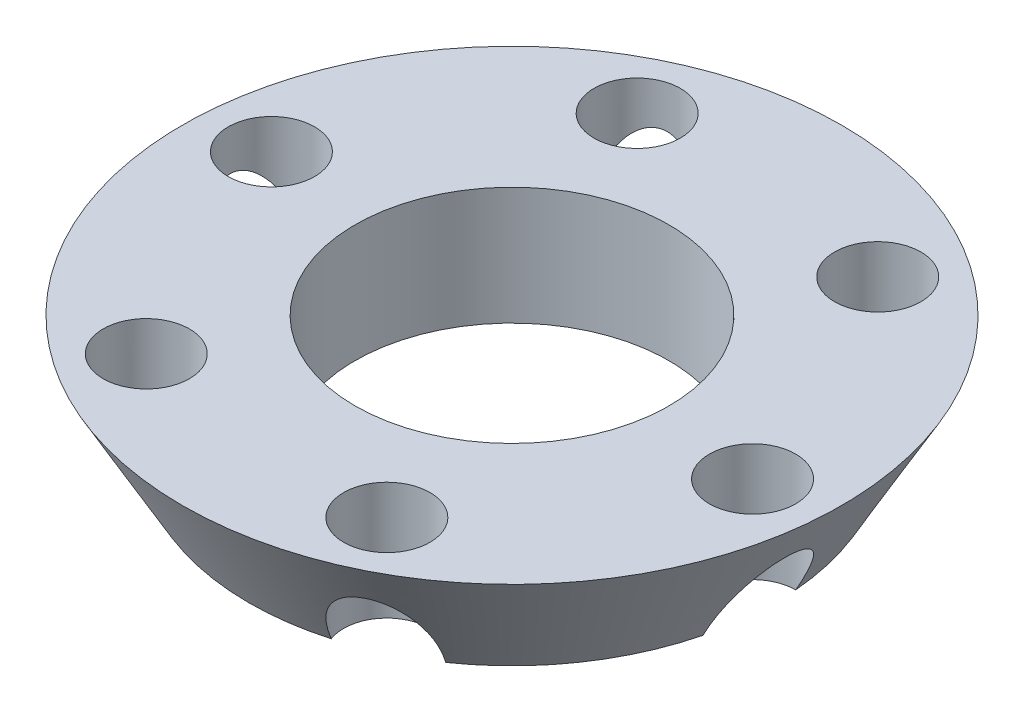
ISO-10303-21;
HEADER;
FILE_DESCRIPTION(('STEP AP214'),'2;1');
FILE_NAME('part.step','',(''),(''),'','','');
FILE_SCHEMA(('AUTOMOTIVE_DESIGN { 1 0 10303 214 1 1 1 1 }'));
ENDSEC;
DATA;
#1=APPLICATION_CONTEXT('core data for automotive mechanical design processes');
#2=APPLICATION_PROTOCOL_DEFINITION('international standard','automotive_design',2000,#1);
#3=PRODUCT_CONTEXT('',#1,'mechanical');
#4=PRODUCT('Part','Part','',(#3));
#5=PRODUCT_RELATED_PRODUCT_CATEGORY('part','',(#4));
#6=PRODUCT_DEFINITION_FORMATION('','',#4);
#7=PRODUCT_DEFINITION_CONTEXT('part definition',#1,'design');
#8=PRODUCT_DEFINITION('design','',#6,#7);
#9=PRODUCT_DEFINITION_SHAPE('','',#8);
#10=(LENGTH_UNIT() NAMED_UNIT(*) SI_UNIT(.MILLI.,.METRE.));
#11=(NAMED_UNIT(*) PLANE_ANGLE_UNIT() SI_UNIT($,.RADIAN.));
#12=(NAMED_UNIT(*) SI_UNIT($,.STERADIAN.) SOLID_ANGLE_UNIT());
#13=UNCERTAINTY_MEASURE_WITH_UNIT(LENGTH_MEASURE(1.E-05),#10,'distance_accuracy_value','');
#14=(GEOMETRIC_REPRESENTATION_CONTEXT(3) GLOBAL_UNCERTAINTY_ASSIGNED_CONTEXT((#13)) GLOBAL_UNIT_ASSIGNED_CONTEXT((#10,
#11,#12)) REPRESENTATION_CONTEXT('',''));
#15=CARTESIAN_POINT('',(0.,0.,0.));
#16=DIRECTION('',(0.,0.,1.));
#17=DIRECTION('',(1.,0.,0.));
#18=AXIS2_PLACEMENT_3D('',#15,#16,#17);
#19=CARTESIAN_POINT('',(0.,0.,0.));
#20=DIRECTION('',(0.,1.,0.));
#21=DIRECTION('',(0.,0.,1.));
#22=AXIS2_PLACEMENT_3D('',#19,#20,#21);
#23=CONICAL_SURFACE('',#22,16.75,0.515549007458979);
#24=CARTESIAN_POINT('',(0.,7.5,0.));
#25=DIRECTION('',(0.,1.,0.));
#26=DIRECTION('',(0.,0.,1.));
#27=AXIS2_PLACEMENT_3D('',#24,#25,#26);
#28=CIRCLE('',#27,21.);
#29=CARTESIAN_POINT('',(0.,7.5,21.));
#30=VERTEX_POINT('',#29);
#31=EDGE_CURVE('E136',#30,#30,#28,.T.);
#32=ORIENTED_EDGE('',*,*,#31,.F.);
#33=EDGE_LOOP('',(#32));
#34=FACE_BOUND('',#33,.T.);
#35=CARTESIAN_POINT('',(0.,0.,0.));
#36=DIRECTION('',(0.,1.,0.));
#37=DIRECTION('',(0.,0.,1.));
#38=AXIS2_PLACEMENT_3D('',#35,#36,#37);
#39=CIRCLE('',#38,16.75);
#40=CARTESIAN_POINT('',(9.54559790588086,0.,13.7638672133952));
#41=VERTEX_POINT('',#40);
#42=CARTESIAN_POINT('',(16.2458956094308,0.,4.07840359055817));
#43=VERTEX_POINT('',#42);
#44=EDGE_CURVE('E80',#41,#43,#39,.T.);
#45=ORIENTED_EDGE('',*,*,#44,.T.);
#46=CARTESIAN_POINT('',(16.2457834145786,-0.000199999999995974,4.07838504714579));
#47=CARTESIAN_POINT('',(16.302175127827,0.100324825842667,4.0877024616442));
#48=CARTESIAN_POINT('',(16.3589611894642,0.200780549594868,4.09528760056878));
#49=CARTESIAN_POINT('',(16.4732837268238,0.40148231099813,4.10691214319564));
#50=CARTESIAN_POINT('',(16.5308202743874,0.501728327492953,4.11095120487968));
#51=CARTESIAN_POINT('',(16.7047070615787,0.802405051376368,4.11763392608114));
#52=CARTESIAN_POINT('',(16.8221146213843,1.00238253421597,4.11480619108231));
#53=CARTESIAN_POINT('',(17.0596190871946,1.40084773593813,4.09344245155099));
#54=CARTESIAN_POINT('',(17.1797240030497,1.59932773603911,4.07485120512848));
#55=CARTESIAN_POINT('',(17.4214766125525,1.99276190965569,4.02020391943906));
#56=CARTESIAN_POINT('',(17.5431226495223,2.18771939962429,3.98416530263437));
#57=CARTESIAN_POINT('',(17.7210303415718,2.4683763125559,3.9170324164156));
#58=CARTESIAN_POINT('',(17.7770655790026,2.55613031469017,3.8938089577649));
#59=CARTESIAN_POINT('',(17.8891192186891,2.73030656197177,3.8428281058794));
#60=CARTESIAN_POINT('',(17.9451376213102,2.81672883844573,3.81507081947404));
#61=CARTESIAN_POINT('',(18.1130741194032,3.07381226223924,3.72438686070991));
#62=CARTESIAN_POINT('',(18.2247941765095,3.24216479725639,3.6540768538819));
#63=CARTESIAN_POINT('',(18.3908252232297,3.48809630694186,3.53061414951551));
#64=CARTESIAN_POINT('',(18.4461993119579,3.56938588819735,3.4861767473179));
#65=CARTESIAN_POINT('',(18.5558459290565,3.72881106158726,3.39062613683313));
#66=CARTESIAN_POINT('',(18.610118138803,3.80694574771973,3.33951102848604));
#67=CARTESIAN_POINT('',(18.7168024072488,3.95888372490284,3.2300601101336));
#68=CARTESIAN_POINT('',(18.7692197731615,4.03269984980142,3.17174748426186));
#69=CARTESIAN_POINT('',(18.8715379013854,4.17496867202895,3.04702174323222));
#70=CARTESIAN_POINT('',(18.9214408869651,4.24342613834306,2.98061596840136));
#71=CARTESIAN_POINT('',(19.0194432977473,4.37574467771692,2.83624564898847));
#72=CARTESIAN_POINT('',(19.0674092544424,4.43934474581093,2.75794626057492));
#73=CARTESIAN_POINT('',(19.1577663352949,4.55644380853141,2.59104618211514));
#74=CARTESIAN_POINT('',(19.2001568417672,4.60994168425614,2.50244435274193));
#75=CARTESIAN_POINT('',(19.2775158592622,4.70404705957815,2.31381181489615));
#76=CARTESIAN_POINT('',(19.3123808599616,4.74447817705664,2.21364765419836));
#77=CARTESIAN_POINT('',(19.3710350323901,4.80743443965891,2.00482190608852));
#78=CARTESIAN_POINT('',(19.3948487689347,4.82999937750279,1.89617979806795));
#79=CARTESIAN_POINT('',(19.426735544893,4.85270496249738,1.6899785505936));
#80=CARTESIAN_POINT('',(19.4365382510215,4.85552982383859,1.59298176384045));
#81=CARTESIAN_POINT('',(19.4457681153882,4.84554421463346,1.39929689200468));
#82=CARTESIAN_POINT('',(19.4451942875545,4.83273225824346,1.30260883713378));
#83=CARTESIAN_POINT('',(19.4349421082914,4.79508536234819,1.12362150645587));
#84=CARTESIAN_POINT('',(19.4262971297393,4.77176814902613,1.04092868205322));
#85=CARTESIAN_POINT('',(19.4023457111545,4.71551582378317,0.879954216808894));
#86=CARTESIAN_POINT('',(19.38703770799,4.68257845559063,0.801673615936039));
#87=CARTESIAN_POINT('',(19.3408659750967,4.58838439734069,0.608468881174297));
#88=CARTESIAN_POINT('',(19.3060811109865,4.52153882346547,0.49721459691286));
#89=CARTESIAN_POINT('',(19.2269176144129,4.37433300701095,0.287789195837885));
#90=CARTESIAN_POINT('',(19.1825125796073,4.2939357095665,0.189655310772523));
#91=CARTESIAN_POINT('',(19.0960359579004,4.13983382734168,0.023162383591909));
#92=CARTESIAN_POINT('',(19.0551089036005,4.06773514557948,-0.0473189863285882));
#93=CARTESIAN_POINT('',(18.9698894480725,3.9187643378716,-0.180871883109599));
#94=CARTESIAN_POINT('',(18.9255948925077,3.84188916203929,-0.243938599680744));
#95=CARTESIAN_POINT('',(18.8344089266928,3.68438254999452,-0.363370730179363));
#96=CARTESIAN_POINT('',(18.787513807288,3.60374577609714,-0.419726191821134));
#97=CARTESIAN_POINT('',(18.6917699641385,3.43958417883313,-0.526259085946489));
#98=CARTESIAN_POINT('',(18.6429205358852,3.35605831547543,-0.576434263424236));
#99=CARTESIAN_POINT('',(18.5044949302262,3.11973279044761,-0.708612423967674));
#100=CARTESIAN_POINT('',(18.4132709886688,2.96440314818071,-0.784393727779774));
#101=CARTESIAN_POINT('',(18.2278648508217,2.64872366899106,-0.920361064064815));
#102=CARTESIAN_POINT('',(18.1336802934595,2.48836982564886,-0.980534276249859));
#103=CARTESIAN_POINT('',(17.9433744148279,2.16385403163172,-1.08717551732313));
#104=CARTESIAN_POINT('',(17.8472495529699,1.9996850172257,-1.13361550289679));
#105=CARTESIAN_POINT('',(17.6541151029051,1.66896013446452,-1.21396961741687));
#106=CARTESIAN_POINT('',(17.5571058617444,1.50240518887262,-1.2478884599517));
#107=CARTESIAN_POINT('',(17.3314983733174,1.11374359985294,-1.31329214187503));
#108=CARTESIAN_POINT('',(17.2027657967137,0.890983275946897,-1.34049289883493));
#109=CARTESIAN_POINT('',(17.0104774062533,0.556476473421859,-1.36731465314002));
#110=CARTESIAN_POINT('',(16.9467511944364,0.445326009111038,-1.37392636522623));
#111=CARTESIAN_POINT('',(16.8194878746836,0.222746444921253,-1.38268421250332));
#112=CARTESIAN_POINT('',(16.7559507592794,0.111317356375088,-1.38483052645477));
#113=CARTESIAN_POINT('',(16.6925444906577,-0.000199999999998144,-1.3847966542393));
#114=B_SPLINE_CURVE_WITH_KNOTS('',3,(#46,#47,#48,#49,#50,#51,#52,#53,#54,#55,#56,#57,#58,#59,
#60,#61,#62,#63,#64,#65,#66,#67,#68,#69,#70,#71,#72,#73,#74,#75,#76,#77,#78,#79,#80,#81,#82,#83,
#84,#85,#86,#87,#88,#89,#90,#91,#92,#93,#94,#95,#96,#97,#98,#99,#100,#101,#102,#103,#104,#105,
#106,#107,#108,#109,#110,#111,#112,#113),.UNSPECIFIED.,.F.,.F.,(4,2,2,2,2,2,2,2,2,2,2,2,2,2,2,2,
2,2,2,2,2,2,2,2,2,2,2,2,2,2,2,2,2,4),(0.,0.346883433123776,0.693800319390656,1.38898423849557,
2.08661448793963,2.78354953549463,3.10348603008158,3.42341498717202,4.06372436430891,
4.38731933820733,4.71100658847554,5.0336771536517,5.35605721097546,5.69027239091061,
6.02452456626997,6.36311654490102,6.70095225117751,6.99176152844596,7.28259844118191,
7.54065788536925,7.79877790242766,8.19961146246676,8.60155936101379,8.92755685381976,
9.25376468535514,9.58045038871827,9.907254939298,10.4925881298666,11.0784005939849,
11.6654011581569,12.2521805198816,13.0275034707226,13.4123212473931,13.7971236185899),.UNSPECIFIED.);
#115=CARTESIAN_POINT('',(16.6926595634952,0.,-1.38479683579284));
#116=VERTEX_POINT('',#115);
#117=EDGE_CURVE('E12',#43,#116,#114,.T.);
#118=ORIENTED_EDGE('',*,*,#117,.T.);
#119=CARTESIAN_POINT('',(11.6549489210247,0.,-12.0301565097178));
#120=VERTEX_POINT('',#119);
#121=EDGE_CURVE('E261',#116,#120,#39,.T.);
#122=ORIENTED_EDGE('',*,*,#121,.T.);
#123=CARTESIAN_POINT('',(11.6548767645324,-0.000200000000001229,-12.0300686178317));
#124=CARTESIAN_POINT('',(11.6911417388099,0.100324825842663,-12.0742465668186));
#125=CARTESIAN_POINT('',(11.7261036926284,0.200780549594865,-12.119632169315));
#126=CARTESIAN_POINT('',(11.7933321105305,0.401482310998129,-12.21282611958));
#127=CARTESIAN_POINT('',(11.8255983143381,0.501728327492952,-12.2606347005742));
#128=CARTESIAN_POINT('',(11.9183291142607,0.80240505137637,-12.4078837150635));
#129=CARTESIAN_POINT('',(11.9745840038193,1.00238253421598,-12.5109755119509));
#130=CARTESIAN_POINT('',(12.0748346955706,1.40084773593814,-12.7273422826204));
#131=CARTESIAN_POINT('',(12.1187866618083,1.59932773603913,-12.8406518140816));
#132=CARTESIAN_POINT('',(12.1923370289049,1.99276190965572,-13.0773393581869));
#133=CARTESIAN_POINT('',(12.2219496897197,2.18771939962433,-13.2007072248747));
#134=CARTESIAN_POINT('',(12.2527647508497,2.468376312556,-13.3883462488276));
#135=CARTESIAN_POINT('',(12.2606702644099,2.55613031469033,-13.4484859172752));
#136=CARTESIAN_POINT('',(12.2725463714137,2.73030656197204,-13.571017641773));
#137=CARTESIAN_POINT('',(12.2765170575572,2.81672883844606,-13.633409644725));
#138=CARTESIAN_POINT('',(12.2819506945982,3.07381226223973,-13.8241888976782));
#139=CARTESIAN_POINT('',(12.2769204710981,3.24216479725699,-13.9560963086586));
#140=CARTESIAN_POINT('',(12.253014156057,3.48809630694262,-14.1616147651185));
#141=CARTESIAN_POINT('',(12.2422172812398,3.56938588819815,-14.2317888337674));
#142=CARTESIAN_POINT('',(12.2142913337622,3.72881106158817,-14.3745208948563));
#143=CARTESIAN_POINT('',(12.1971604562897,3.80694574772069,-14.4470795613899));
#144=CARTESIAN_POINT('',(12.1557153147518,3.9588837249039,-14.5941963072243));
#145=CARTESIAN_POINT('',(12.1314237823419,4.03269984980253,-14.6687473906401));
#146=CARTESIAN_POINT('',(12.0745671862163,4.17496867203015,-14.8197203594646));
#147=CARTESIAN_POINT('',(12.0420095910447,4.24342613834431,-14.8961405001168));
#148=CARTESIAN_POINT('',(11.9659824322717,4.37574467771822,-15.0531982371928));
#149=CARTESIAN_POINT('',(11.9221561511524,4.43934474581223,-15.1338876684144));
#150=CARTESIAN_POINT('',(11.8227949837388,4.55644380853272,-15.2955892350743));
#151=CARTESIAN_POINT('',(11.767258801916,4.60994168425746,-15.3766014052452));
#152=CARTESIAN_POINT('',(11.6425777409088,4.70404705957949,-15.5379125485306));
#153=CARTESIAN_POINT('',(11.5732655335454,4.74447817705799,-15.6181886051881));
#154=CARTESIAN_POINT('',(11.4217442169323,4.80743443966028,-15.7733974826041));
#155=CARTESIAN_POINT('',(11.3395642597381,4.82999937750417,-15.848341837421));
#156=CARTESIAN_POINT('',(11.1769321291124,4.85270496249878,-15.9790572191829));
#157=CARTESIAN_POINT('',(11.097831800763,4.85552982384,-16.0360450050926));
#158=CARTESIAN_POINT('',(10.9347107136078,4.84554421463489,-16.1408807380256));
#159=CARTESIAN_POINT('',(10.8506894879303,4.8327322582449,-16.1887278159797));
#160=CARTESIAN_POINT('',(10.6905558229761,4.79508536234964,-16.2693428336327));
#161=CARTESIAN_POINT('',(10.6146192470566,4.77176814902758,-16.3032024747926));
#162=CARTESIAN_POINT('',(10.463235561502,4.71551582378464,-16.3629471704637));
#163=CARTESIAN_POINT('',(10.3877885709404,4.6825784555921,-16.3888303512785));
#164=CARTESIAN_POINT('',(10.1973824960586,4.58838439734218,-16.445446825037));
#165=CARTESIAN_POINT('',(10.0836410275533,4.52153882346697,-16.4709493911812));
#166=CARTESIAN_POINT('',(9.86269156173785,4.37433300701248,-16.5071044926335));
#167=CARTESIAN_POINT('',(9.75550260689639,4.29393570956804,-16.5177155469686));
#168=CARTESIAN_POINT('',(9.5680771915541,4.13983382734325,-16.5260710593273));
#169=CARTESIAN_POINT('',(9.48657500755946,4.06773514558106,-16.5258678755617));
#170=CARTESIAN_POINT('',(9.32830507843415,3.91876433787321,-16.5188421105684));
#171=CARTESIAN_POINT('',(9.25154042196783,3.84188916204092,-16.5120152584854));
#172=CARTESIAN_POINT('',(9.10251618002049,3.68438254999617,-16.4927619608704));
#173=CARTESIAN_POINT('',(9.03026335889433,3.60374577609881,-16.4803273269733));
#174=CARTESIAN_POINT('',(8.89013124466836,3.43958417883482,-16.4506771736126));
#175=CARTESIAN_POINT('',(8.82225355220661,3.35605831547713,-16.4334599165238));
#176=CARTESIAN_POINT('',(8.63857110452097,3.11973279044935,-16.3796689057605));
#177=CARTESIAN_POINT('',(8.5273305995091,2.96440314818248,-16.3385573068446));
#178=CARTESIAN_POINT('',(8.31687636327783,2.64872366899288,-16.245974549594));
#179=CARTESIAN_POINT('',(8.21767255421718,2.48836982565071,-16.1944949363667));
#180=CARTESIAN_POINT('',(8.03016559104082,2.16385403163361,-16.0830058315189));
#181=CARTESIAN_POINT('',(7.94188495285365,1.99968501722761,-16.0229792520015));
#182=CARTESIAN_POINT('',(7.77572902334824,1.66896013446649,-15.8958969691595));
#183=CARTESIAN_POINT('',(7.69784982346579,1.50240518887461,-15.8288439231799));
#184=CARTESIAN_POINT('',(7.52840482920543,1.11374359985462,-15.6661639478796));
#185=CARTESIAN_POINT('',(7.440481994374,0.890983275948242,-15.568278644726));
#186=CARTESIAN_POINT('',(7.32110947854137,0.556476473422697,-15.4151628908868));
#187=CARTESIAN_POINT('',(7.28352046200372,0.445326009111708,-15.3632802286095));
#188=CARTESIAN_POINT('',(7.21230428390282,0.222746444921588,-15.257445884372));
#189=CARTESIAN_POINT('',(7.17867696379422,0.111317356375255,-15.2034942853244));
#190=CARTESIAN_POINT('',(7.14700316368239,-0.000199999999997017,-15.1485659098309));
#191=B_SPLINE_CURVE_WITH_KNOTS('',3,(#123,#124,#125,#126,#127,#128,#129,#130,#131,#132,#133,
#134,#135,#136,#137,#138,#139,#140,#141,#142,#143,#144,#145,#146,#147,#148,#149,#150,#151,#152,
#153,#154,#155,#156,#157,#158,#159,#160,#161,#162,#163,#164,#165,#166,#167,#168,#169,#170,#171,
#172,#173,#174,#175,#176,#177,#178,#179,#180,#181,#182,#183,#184,#185,#186,#187,#188,#189,#190),
.UNSPECIFIED.,.F.,.F.,(4,2,2,2,2,2,2,2,2,2,2,2,2,2,2,2,2,2,2,2,2,2,2,2,2,2,2,2,2,2,2,2,2,4),(0.,
0.346883433123777,0.693800319390655,1.38898423849557,2.08661448793962,2.78354953549462,
3.10348603008174,3.42341498717236,4.06372436430961,4.38731933820821,4.7110065884766,
5.03367715365294,5.35605721097688,5.69027239091203,6.0245245662714,6.36311654490245,
6.70095225117894,6.99176152844742,7.28259844118339,7.54065788537072,7.79877790242914,
8.19961146246819,8.60155936101519,8.92755685382111,9.25376468535645,9.58045038871954,
9.90725493929922,10.4925881298677,11.078400593986,11.6654011581579,12.2521805198826,
13.0275034707247,13.4123212473957,13.7971236185932),.UNSPECIFIED.);
#192=CARTESIAN_POINT('',(7.14705985748153,0.,-15.1486642038932));
#193=VERTEX_POINT('',#192);
#194=EDGE_CURVE('E353',#120,#193,#191,.T.);
#195=ORIENTED_EDGE('',*,*,#194,.T.);
#196=CARTESIAN_POINT('',(-4.59094668840506,0.,-16.1085601002766));
#197=VERTEX_POINT('',#196);
#198=EDGE_CURVE('E266',#193,#197,#39,.T.);
#199=ORIENTED_EDGE('',*,*,#198,.T.);
#200=CARTESIAN_POINT('',(-4.59090665004514,-0.000199999999998536,-16.1084536649782));
#201=CARTESIAN_POINT('',(-4.61103338901614,0.100324825842664,-16.1619490284635));
#202=CARTESIAN_POINT('',(-4.63285749683477,0.200780549594866,-16.2149197698844));
#203=CARTESIAN_POINT('',(-4.67995161629231,0.401482310998131,-16.3197382627764));
#204=CARTESIAN_POINT('',(-4.70522196004829,0.501728327492954,-16.3715859054546));
#205=CARTESIAN_POINT('',(-4.78637794731697,0.802405051376374,-16.5255176411454));
#206=CARTESIAN_POINT('',(-4.84753061756388,1.00238253421598,-16.625781703034));
#207=CARTESIAN_POINT('',(-4.9847843916229,1.40084773593814,-16.8207847341724));
#208=CARTESIAN_POINT('',(-5.06093734124036,1.59932773603913,-16.9155030192111));
#209=CARTESIAN_POINT('',(-5.22913958364655,1.99276190965572,-17.097543277627));
#210=CARTESIAN_POINT('',(-5.32117295980151,2.18771939962433,-17.1848725275102));
#211=CARTESIAN_POINT('',(-5.46826559072105,2.468376312556,-17.3053786652445));
#212=CARTESIAN_POINT('',(-5.51639531459171,2.55613031469033,-17.3422948750413));
#213=CARTESIAN_POINT('',(-5.61657284727437,2.73030656197204,-17.4138457476536));
#214=CARTESIAN_POINT('',(-5.66862056375212,2.81672883844605,-17.4484804642003));
#215=CARTESIAN_POINT('',(-5.83112342480409,3.07381226223973,-17.5485757583894));
#216=CARTESIAN_POINT('',(-5.94787370541059,3.24216479725698,-17.6101731625418));
#217=CARTESIAN_POINT('',(-6.13781106717197,3.48809630694261,-17.6922289146353));
#218=CARTESIAN_POINT('',(-6.2039820307174,3.56938588819814,-17.7179655810865));
#219=CARTESIAN_POINT('',(-6.34155459529367,3.72881106158816,-17.7651470316906));
#220=CARTESIAN_POINT('',(-6.41295768251275,3.80694574772068,-17.7865905898772));
#221=CARTESIAN_POINT('',(-6.56108709249644,3.95888372490389,-17.8242564173592));
#222=CARTESIAN_POINT('',(-6.63779599081913,4.03269984980252,-17.8404948749032));
#223=CARTESIAN_POINT('',(-6.79697071516868,4.17496867203013,-17.866742102698));
#224=CARTESIAN_POINT('',(-6.87943129592009,4.24342613834429,-17.8767564685193));
#225=CARTESIAN_POINT('',(-7.05346086547526,4.3757446777182,-17.8894438861824));
#226=CARTESIAN_POINT('',(-7.14525310328972,4.43934474581221,-17.8918339289904));
#227=CARTESIAN_POINT('',(-7.33497135155574,4.55644380853271,-17.8866354171906));
#228=CARTESIAN_POINT('',(-7.43289803985088,4.60994168425744,-17.8790457579883));
#229=CARTESIAN_POINT('',(-7.63493811835316,4.70404705957947,-17.851724363428));
#230=CARTESIAN_POINT('',(-7.73911532641586,4.74447817705797,-17.8318362593877));
#231=CARTESIAN_POINT('',(-7.94929081545752,4.80743443966026,-17.7782193886938));
#232=CARTESIAN_POINT('',(-8.05528450919632,4.82999937750415,-17.7445216354902));
#233=CARTESIAN_POINT('',(-8.24980341578036,4.85270496249877,-17.6690357697778));
#234=CARTESIAN_POINT('',(-8.33870645025832,4.85552982383998,-17.6290267689343));
#235=CARTESIAN_POINT('',(-8.5110574017802,4.84554421463487,-17.5401776300315));
#236=CARTESIAN_POINT('',(-8.59450479962406,4.83273225824487,-17.4913366531147));
#237=CARTESIAN_POINT('',(-8.74438628531518,4.79508536234962,-17.3929643400897));
#238=CARTESIAN_POINT('',(-8.81167788268248,4.77176814902757,-17.3441311568471));
#239=CARTESIAN_POINT('',(-8.9391101496523,4.71551582378463,-17.2429013872738));
#240=CARTESIAN_POINT('',(-8.99924913704949,4.68257845559208,-17.1905039672158));
#241=CARTESIAN_POINT('',(-9.14348347903792,4.58838439734215,-17.0539157062125));
#242=CARTESIAN_POINT('',(-9.22244008343311,4.52153882346694,-16.9681639880953));
#243=CARTESIAN_POINT('',(-9.36422605267499,4.37433300701246,-16.7948936884726));
#244=CARTESIAN_POINT('',(-9.42700997271086,4.29393570956802,-16.7073708577424));
#245=CARTESIAN_POINT('',(-9.52795876634627,4.13983382734323,-16.5492334429205));
#246=CARTESIAN_POINT('',(-9.56853389604099,4.06773514558104,-16.4785488892344));
#247=CARTESIAN_POINT('',(-9.6415843696384,3.91876433787319,-16.3379702274601));
#248=CARTESIAN_POINT('',(-9.67405447053985,3.84188916204089,-16.268076658806));
#249=CARTESIAN_POINT('',(-9.73189274667232,3.68438254999614,-16.1293912306924));
#250=CARTESIAN_POINT('',(-9.75725044839371,3.60374577609878,-16.0606011351535));
#251=CARTESIAN_POINT('',(-9.80163871947022,3.43958417883479,-15.9244180876674));
#252=CARTESIAN_POINT('',(-9.82066698367873,3.3560583154771,-15.8570256531009));
#253=CARTESIAN_POINT('',(-9.86592382570533,3.11973279044932,-15.6710564817942));
#254=CARTESIAN_POINT('',(-9.88594038915985,2.96440314818244,-15.5541635790661));
#255=CARTESIAN_POINT('',(-9.91098848754411,2.64872366899284,-15.3256134855305));
#256=CARTESIAN_POINT('',(-9.9160077392426,2.48836982565067,-15.2139606601181));
#257=CARTESIAN_POINT('',(-9.91320882378738,2.16385403163357,-14.995830314197));
#258=CARTESIAN_POINT('',(-9.90536460011658,1.99968501722757,-14.8893637491059));
#259=CARTESIAN_POINT('',(-9.87838607955721,1.66896013446644,-14.6819273517438));
#260=CARTESIAN_POINT('',(-9.85925603827902,1.50240518887456,-14.5809554632294));
#261=CARTESIAN_POINT('',(-9.80309354411213,1.11374359985458,-14.3528718060057));
#262=CARTESIAN_POINT('',(-9.76228380233966,0.890983275948215,-14.2277857458921));
#263=CARTESIAN_POINT('',(-9.68936792771165,0.556476473422687,-14.0478482377478));
#264=CARTESIAN_POINT('',(-9.66323073243235,0.445326009111704,-13.9893538633843));
#265=CARTESIAN_POINT('',(-9.60718359078029,0.222746444921593,-13.8747616718697));
#266=CARTESIAN_POINT('',(-9.57727379548459,0.111317356375266,-13.8186637588707));
#267=CARTESIAN_POINT('',(-9.54554132697456,-0.000199999999981395,-13.7637692555927));
#268=B_SPLINE_CURVE_WITH_KNOTS('',3,(#200,#201,#202,#203,#204,#205,#206,#207,#208,#209,#210,
#211,#212,#213,#214,#215,#216,#217,#218,#219,#220,#221,#222,#223,#224,#225,#226,#227,#228,#229,
#230,#231,#232,#233,#234,#235,#236,#237,#238,#239,#240,#241,#242,#243,#244,#245,#246,#247,#248,
#249,#250,#251,#252,#253,#254,#255,#256,#257,#258,#259,#260,#261,#262,#263,#264,#265,#266,#267),
.UNSPECIFIED.,.F.,.F.,(4,2,2,2,2,2,2,2,2,2,2,2,2,2,2,2,2,2,2,2,2,2,2,2,2,2,2,2,2,2,2,2,2,4),(0.,
0.346883433123777,0.693800319390656,1.38898423849557,2.08661448793962,2.78354953549462,
3.10348603008174,3.42341498717236,4.0637243643096,4.38731933820819,4.71100658847659,
5.03367715365292,5.35605721097686,5.69027239091201,6.02452456627138,6.36311654490243,
6.70095225117893,6.9917615284474,7.28259844118337,7.54065788537071,7.79877790242912,
8.19961146246818,8.60155936101517,8.92755685382109,9.25376468535644,9.58045038871953,
9.90725493929921,10.4925881298677,11.078400593986,11.6654011581579,12.2521805198826,
13.0275034707247,13.4123212473957,13.7971236185931),.UNSPECIFIED.);
#269=CARTESIAN_POINT('',(-9.54559790587994,0.,-13.7638672133958));
#270=VERTEX_POINT('',#269);
#271=EDGE_CURVE('E351',#197,#270,#268,.T.);
#272=ORIENTED_EDGE('',*,*,#271,.T.);
#273=CARTESIAN_POINT('',(-16.2458956094303,0.,-4.07840359055998));
#274=VERTEX_POINT('',#273);
#275=EDGE_CURVE('E154',#270,#274,#39,.T.);
#276=ORIENTED_EDGE('',*,*,#275,.T.);
#277=CARTESIAN_POINT('',(-16.2457834145781,-0.000199999999994494,-4.0783850471476));
#278=CARTESIAN_POINT('',(-16.3021751278266,0.100324825842668,-4.08770246164601));
#279=CARTESIAN_POINT('',(-16.3589611894637,0.200780549594869,-4.0952876005706));
#280=CARTESIAN_POINT('',(-16.4732837268233,0.401482310998131,-4.10691214319747));
#281=CARTESIAN_POINT('',(-16.530820274387,0.501728327492953,-4.11095120488152));
#282=CARTESIAN_POINT('',(-16.7047070615782,0.802405051376368,-4.11763392608299));
#283=CARTESIAN_POINT('',(-16.8221146213838,1.00238253421597,-4.11480619108417));
#284=CARTESIAN_POINT('',(-17.0596190871941,1.40084773593813,-4.09344245155288));
#285=CARTESIAN_POINT('',(-17.1797240030493,1.59932773603911,-4.07485120513038));
#286=CARTESIAN_POINT('',(-17.4214766125521,1.99276190965569,-4.02020391944099));
#287=CARTESIAN_POINT('',(-17.5431226495219,2.18771939962429,-3.98416530263631));
#288=CARTESIAN_POINT('',(-17.7210303415714,2.46837631255589,-3.91703241641756));
#289=CARTESIAN_POINT('',(-17.7770655790022,2.55613031469017,-3.89380895776686));
#290=CARTESIAN_POINT('',(-17.8891192186887,2.73030656197177,-3.84282810588137));
#291=CARTESIAN_POINT('',(-17.9451376213098,2.81672883844572,-3.81507081947602));
#292=CARTESIAN_POINT('',(-18.1130741194027,3.07381226223923,-3.7243868607119));
#293=CARTESIAN_POINT('',(-18.2247941765091,3.24216479725637,-3.6540768538839));
#294=CARTESIAN_POINT('',(-18.3908252232293,3.48809630694184,-3.53061414951754));
#295=CARTESIAN_POINT('',(-18.4461993119575,3.56938588819733,-3.48617674731993));
#296=CARTESIAN_POINT('',(-18.5558459290561,3.72881106158724,-3.39062613683518));
#297=CARTESIAN_POINT('',(-18.6101181388027,3.8069457477197,-3.3395110284881));
#298=CARTESIAN_POINT('',(-18.7168024072484,3.95888372490281,-3.23006011013566));
#299=CARTESIAN_POINT('',(-18.7692197731611,4.03269984980139,-3.17174748426393));
#300=CARTESIAN_POINT('',(-18.8715379013851,4.17496867202891,-3.0470217432343));
#301=CARTESIAN_POINT('',(-18.9214408869648,4.24342613834303,-2.98061596840344));
#302=CARTESIAN_POINT('',(-19.019443297747,4.37574467771689,-2.83624564899057));
#303=CARTESIAN_POINT('',(-19.0674092544421,4.43934474581089,-2.75794626057702));
#304=CARTESIAN_POINT('',(-19.1577663352946,4.55644380853137,-2.59104618211726));
#305=CARTESIAN_POINT('',(-19.2001568417669,4.6099416842561,-2.50244435274404));
#306=CARTESIAN_POINT('',(-19.277515859262,4.70404705957811,-2.31381181489827));
#307=CARTESIAN_POINT('',(-19.3123808599613,4.74447817705661,-2.21364765420049));
#308=CARTESIAN_POINT('',(-19.3710350323898,4.80743443965888,-2.00482190609065));
#309=CARTESIAN_POINT('',(-19.3948487689344,4.82999937750275,-1.89617979807009));
#310=CARTESIAN_POINT('',(-19.4267355448928,4.85270496249734,-1.68997855059574));
#311=CARTESIAN_POINT('',(-19.4365382510214,4.85552982383855,-1.59298176384259));
#312=CARTESIAN_POINT('',(-19.4457681153881,4.84554421463342,-1.39929689200683));
#313=CARTESIAN_POINT('',(-19.4451942875544,4.83273225824341,-1.30260883713593));
#314=CARTESIAN_POINT('',(-19.4349421082913,4.79508536234815,-1.12362150645801));
#315=CARTESIAN_POINT('',(-19.4262971297391,4.77176814902609,-1.04092868205536));
#316=CARTESIAN_POINT('',(-19.4023457111544,4.71551582378314,-0.879954216811034));
#317=CARTESIAN_POINT('',(-19.3870377079899,4.68257845559059,-0.801673615938178));
#318=CARTESIAN_POINT('',(-19.3408659750966,4.58838439734064,-0.608468881176432));
#319=CARTESIAN_POINT('',(-19.3060811109865,4.52153882346542,-0.497214596914992));
#320=CARTESIAN_POINT('',(-19.2269176144129,4.37433300701091,-0.287789195840011));
#321=CARTESIAN_POINT('',(-19.1825125796073,4.29393570956645,-0.189655310774645));
#322=CARTESIAN_POINT('',(-19.0960359579004,4.13983382734163,-0.0231623835940201));
#323=CARTESIAN_POINT('',(-19.0551089036004,4.06773514557944,0.0473189863264847));
#324=CARTESIAN_POINT('',(-18.9698894480725,3.91876433787156,0.180871883107505));
#325=CARTESIAN_POINT('',(-18.9255948925077,3.84188916203925,0.243938599678653));
#326=CARTESIAN_POINT('',(-18.8344089266928,3.68438254999447,0.363370730177281));
#327=CARTESIAN_POINT('',(-18.787513807288,3.6037457760971,0.419726191819059));
#328=CARTESIAN_POINT('',(-18.6917699641385,3.43958417883308,0.526259085944425));
#329=CARTESIAN_POINT('',(-18.6429205358853,3.35605831547538,0.576434263422177));
#330=CARTESIAN_POINT('',(-18.5044949302262,3.11973279044756,0.708612423965629));
#331=CARTESIAN_POINT('',(-18.4132709886688,2.96440314818066,0.78439372777774));
#332=CARTESIAN_POINT('',(-18.2278648508218,2.64872366899101,0.920361064062803));
#333=CARTESIAN_POINT('',(-18.1336802934596,2.48836982564881,0.980534276247858));
#334=CARTESIAN_POINT('',(-17.943374414828,2.16385403163167,1.08717551732115));
#335=CARTESIAN_POINT('',(-17.84724955297,1.99968501722564,1.13361550289482));
#336=CARTESIAN_POINT('',(-17.6541151029052,1.66896013446446,1.21396961741492));
#337=CARTESIAN_POINT('',(-17.5571058617446,1.50240518887256,1.24788845994975));
#338=CARTESIAN_POINT('',(-17.3314983733175,1.11374359985289,1.31329214187311));
#339=CARTESIAN_POINT('',(-17.2027657967138,0.890983275946859,1.34049289883302));
#340=CARTESIAN_POINT('',(-17.0104774062534,0.556476473421837,1.36731465313813));
#341=CARTESIAN_POINT('',(-16.9467511944366,0.445326009111021,1.37392636522436));
#342=CARTESIAN_POINT('',(-16.8194878746838,0.222746444921246,1.38268421250146));
#343=CARTESIAN_POINT('',(-16.7559507592796,0.111317356375085,1.38483052645292));
#344=CARTESIAN_POINT('',(-16.6925444906578,-0.000199999999997812,1.38479665423745));
#345=B_SPLINE_CURVE_WITH_KNOTS('',3,(#277,#278,#279,#280,#281,#282,#283,#284,#285,#286,#287,
#288,#289,#290,#291,#292,#293,#294,#295,#296,#297,#298,#299,#300,#301,#302,#303,#304,#305,#306,
#307,#308,#309,#310,#311,#312,#313,#314,#315,#316,#317,#318,#319,#320,#321,#322,#323,#324,#325,
#326,#327,#328,#329,#330,#331,#332,#333,#334,#335,#336,#337,#338,#339,#340,#341,#342,#343,#344),
.UNSPECIFIED.,.F.,.F.,(4,2,2,2,2,2,2,2,2,2,2,2,2,2,2,2,2,2,2,2,2,2,2,2,2,2,2,2,2,2,2,2,2,4),(0.,
0.346883433123777,0.693800319390656,1.38898423849557,2.08661448793963,2.78354953549464,
3.10348603008158,3.42341498717201,4.06372436430889,4.3873193382073,4.71100658847552,
5.03367715365167,5.35605721097542,5.69027239091057,6.02452456626993,6.36311654490098,
6.70095225117747,6.99176152844593,7.28259844118187,7.54065788536921,7.79877790242763,
8.19961146246673,8.60155936101376,8.92755685381972,9.2537646853551,9.58045038871824,
9.90725493929796,10.4925881298665,11.0784005939849,11.6654011581569,12.2521805198816,
13.0275034707226,13.412321247393,13.7971236185899),.UNSPECIFIED.);
#346=CARTESIAN_POINT('',(-16.6926595634952,0.,1.38479683579098));
#347=VERTEX_POINT('',#346);
#348=EDGE_CURVE('E135',#274,#347,#345,.T.);
#349=ORIENTED_EDGE('',*,*,#348,.T.);
#350=CARTESIAN_POINT('',(-11.6549489210255,0.,12.030156509717));
#351=VERTEX_POINT('',#350);
#352=EDGE_CURVE('E143',#347,#351,#39,.T.);
#353=ORIENTED_EDGE('',*,*,#352,.T.);
#354=CARTESIAN_POINT('',(-11.6548767645332,-0.000199999999999733,12.030068617831));
#355=CARTESIAN_POINT('',(-11.6911417388106,0.100324825842662,12.0742465668179));
#356=CARTESIAN_POINT('',(-11.7261036926291,0.200780549594862,12.1196321693143));
#357=CARTESIAN_POINT('',(-11.7933321105311,0.401482310998122,12.2128261195794));
#358=CARTESIAN_POINT('',(-11.8255983143388,0.501728327492943,12.2606347005736));
#359=CARTESIAN_POINT('',(-11.9183291142612,0.802405051376355,12.4078837150629));
#360=CARTESIAN_POINT('',(-11.9745840038198,1.00238253421595,12.5109755119504));
#361=CARTESIAN_POINT('',(-12.074834695571,1.4008477359381,12.72734228262));
#362=CARTESIAN_POINT('',(-12.1187866618086,1.59932773603908,12.8406518140813));
#363=CARTESIAN_POINT('',(-12.1923370289051,1.99276190965564,13.0773393581866));
#364=CARTESIAN_POINT('',(-12.2219496897198,2.18771939962424,13.2007072248745));
#365=CARTESIAN_POINT('',(-12.2527647508497,2.46837631255578,13.3883462488274));
#366=CARTESIAN_POINT('',(-12.2606702644099,2.55613031468999,13.4484859172749));
#367=CARTESIAN_POINT('',(-12.2725463714136,2.73030656197149,13.5710176417726));
#368=CARTESIAN_POINT('',(-12.2765170575571,2.81672883844539,13.6334096447246));
#369=CARTESIAN_POINT('',(-12.281950694598,3.07381226223874,13.8241888976777));
#370=CARTESIAN_POINT('',(-12.2769204710978,3.24216479725578,13.9560963086579));
#371=CARTESIAN_POINT('',(-12.2530141560567,3.48809630694109,14.1616147651177));
#372=CARTESIAN_POINT('',(-12.2422172812394,3.56938588819652,14.2317888337664));
#373=CARTESIAN_POINT('',(-12.2142913337618,3.72881106158633,14.3745208948552));
#374=CARTESIAN_POINT('',(-12.1971604562893,3.80694574771874,14.4470795613887));
#375=CARTESIAN_POINT('',(-12.1557153147515,3.95888372490175,14.5941963072231));
#376=CARTESIAN_POINT('',(-12.1314237823415,4.03269984980029,14.6687473906388));
#377=CARTESIAN_POINT('',(-12.074567186216,4.17496867202771,14.8197203594631));
#378=CARTESIAN_POINT('',(-12.0420095910444,4.24342613834179,14.8961405001152));
#379=CARTESIAN_POINT('',(-11.9659824322715,4.3757446777156,15.0531982371911));
#380=CARTESIAN_POINT('',(-11.9221561511521,4.4393447458096,15.1338876684127));
#381=CARTESIAN_POINT('',(-11.8227949837385,4.55644380853007,15.2955892350726));
#382=CARTESIAN_POINT('',(-11.7672588019157,4.60994168425478,15.3766014052436));
#383=CARTESIAN_POINT('',(-11.6425777409085,4.70404705957678,15.5379125485289));
#384=CARTESIAN_POINT('',(-11.5732655335451,4.74447817705526,15.6181886051864));
#385=CARTESIAN_POINT('',(-11.4217442169319,4.80743443965751,15.7733974826024));
#386=CARTESIAN_POINT('',(-11.3395642597377,4.82999937750137,15.8483418374193));
#387=CARTESIAN_POINT('',(-11.1769321291121,4.85270496249595,15.9790572191812));
#388=CARTESIAN_POINT('',(-11.0978318007626,4.85552982383715,16.0360450050909));
#389=CARTESIAN_POINT('',(-10.9347107136075,4.845544214632,16.1408807380238));
#390=CARTESIAN_POINT('',(-10.8506894879299,4.83273225824199,16.1887278159779));
#391=CARTESIAN_POINT('',(-10.6905558229758,4.79508536234671,16.2693428336309));
#392=CARTESIAN_POINT('',(-10.6146192470563,4.77176814902465,16.3032024747908));
#393=CARTESIAN_POINT('',(-10.4632355615017,4.71551582378169,16.3629471704619));
#394=CARTESIAN_POINT('',(-10.3877885709401,4.68257845558913,16.3888303512767));
#395=CARTESIAN_POINT('',(-10.1973824960583,4.58838439733917,16.4454468250352));
#396=CARTESIAN_POINT('',(-10.083641027553,4.52153882346393,16.4709493911793));
#397=CARTESIAN_POINT('',(-9.86269156173747,4.37433300700939,16.5071044926317));
#398=CARTESIAN_POINT('',(-9.755502606896,4.29393570956493,16.5177155469668));
#399=CARTESIAN_POINT('',(-9.56807719155369,4.13983382734008,16.5260710593254));
#400=CARTESIAN_POINT('',(-9.48657500755903,4.06773514557787,16.5258678755599));
#401=CARTESIAN_POINT('',(-9.3283050784337,3.91876433786996,16.5188421105665));
#402=CARTESIAN_POINT('',(-9.25154042196738,3.84188916203764,16.5120152584836));
#403=CARTESIAN_POINT('',(-9.10251618002001,3.68438254999284,16.4927619608686));
#404=CARTESIAN_POINT('',(-9.03026335889384,3.60374577609545,16.4803273269714));
#405=CARTESIAN_POINT('',(-8.89013124466785,3.43958417883141,16.4506771736107));
#406=CARTESIAN_POINT('',(-8.8222535522061,3.35605831547369,16.4334599165219));
#407=CARTESIAN_POINT('',(-8.63857110452043,3.11973279044584,16.3796689057586));
#408=CARTESIAN_POINT('',(-8.52733059950855,2.96440314817891,16.3385573068426));
#409=CARTESIAN_POINT('',(-8.31687636327726,2.64872366898922,16.245974549592));
#410=CARTESIAN_POINT('',(-8.2176725542166,2.48836982564699,16.1944949363647));
#411=CARTESIAN_POINT('',(-8.03016559104022,2.1638540316298,16.0830058315168));
#412=CARTESIAN_POINT('',(-7.94188495285305,1.99968501722375,16.0229792519993));
#413=CARTESIAN_POINT('',(-7.77572902334763,1.66896013446253,15.8958969691573));
#414=CARTESIAN_POINT('',(-7.69784982346517,1.50240518887061,15.8288439231777));
#415=CARTESIAN_POINT('',(-7.52840482920514,1.11374359985124,15.6661639478776));
#416=CARTESIAN_POINT('',(-7.44048199437398,0.890983275945546,15.5682786447243));
#417=CARTESIAN_POINT('',(-7.32110947854168,0.556476473421024,15.4151628908856));
#418=CARTESIAN_POINT('',(-7.28352046200412,0.445326009110374,15.3632802286084));
#419=CARTESIAN_POINT('',(-7.21230428390339,0.22274644492093,15.2574458843713));
#420=CARTESIAN_POINT('',(-7.17867696379486,0.111317356374935,15.2034942853239));
#421=CARTESIAN_POINT('',(-7.14700316368308,-0.000199999999979234,15.1485659098306));
#422=B_SPLINE_CURVE_WITH_KNOTS('',3,(#354,#355,#356,#357,#358,#359,#360,#361,#362,#363,#364,
#365,#366,#367,#368,#369,#370,#371,#372,#373,#374,#375,#376,#377,#378,#379,#380,#381,#382,#383,
#384,#385,#386,#387,#388,#389,#390,#391,#392,#393,#394,#395,#396,#397,#398,#399,#400,#401,#402,
#403,#404,#405,#406,#407,#408,#409,#410,#411,#412,#413,#414,#415,#416,#417,#418,#419,#420,#421),
.UNSPECIFIED.,.F.,.F.,(4,2,2,2,2,2,2,2,2,2,2,2,2,2,2,2,2,2,2,2,2,2,2,2,2,2,2,2,2,2,2,2,2,4),(0.,
0.346883433123776,0.693800319390654,1.38898423849557,2.08661448793963,2.78354953549465,
3.10348603008141,3.42341498717167,4.0637243643082,4.38731933820643,4.71100658847447,
5.03367715365044,5.35605721097402,5.69027239090916,6.02452456626852,6.36311654489957,
6.70095225117605,6.99176152844449,7.28259844118041,7.54065788536775,7.79877790242617,
8.19961146246531,8.60155936101238,8.92755685381839,9.25376468535381,9.58045038871698,
9.90725493929675,10.4925881298654,11.0784005939838,11.6654011581559,12.2521805198807,
13.0275034707205,13.4123212473903,13.7971236185866),.UNSPECIFIED.);
#423=CARTESIAN_POINT('',(-7.14705985748222,0.,15.1486642038929));
#424=VERTEX_POINT('',#423);
#425=EDGE_CURVE('E129',#351,#424,#422,.T.);
#426=ORIENTED_EDGE('',*,*,#425,.T.);
#427=CARTESIAN_POINT('',(4.59094668840584,0.,16.1085601002764));
#428=VERTEX_POINT('',#427);
#429=EDGE_CURVE('E146',#424,#428,#39,.T.);
#430=ORIENTED_EDGE('',*,*,#429,.T.);
#431=CARTESIAN_POINT('',(4.59090665004593,-0.000199999999998544,16.108453664978));
#432=CARTESIAN_POINT('',(4.61103338901696,0.100324825842662,16.1619490284633));
#433=CARTESIAN_POINT('',(4.63285749683562,0.200780549594861,16.2149197698842));
#434=CARTESIAN_POINT('',(4.67995161629324,0.401482310998121,16.3197382627761));
#435=CARTESIAN_POINT('',(4.70522196004924,0.501728327492942,16.3715859054543));
#436=CARTESIAN_POINT('',(4.78637794731803,0.802405051376354,16.5255176411451));
#437=CARTESIAN_POINT('',(4.84753061756502,1.00238253421595,16.6257817030337));
#438=CARTESIAN_POINT('',(4.98478439162419,1.4008477359381,16.820784734172));
#439=CARTESIAN_POINT('',(5.06093734124172,1.59932773603908,16.9155030192107));
#440=CARTESIAN_POINT('',(5.22913958364808,1.99276190965564,17.0975432776265));
#441=CARTESIAN_POINT('',(5.32117295980312,2.18771939962424,17.1848725275097));
#442=CARTESIAN_POINT('',(5.46826559072274,2.46837631255578,17.3053786652438));
#443=CARTESIAN_POINT('',(5.51639531459339,2.55613031469,17.3422948750406));
#444=CARTESIAN_POINT('',(5.61657284727601,2.7303065619715,17.4138457476528));
#445=CARTESIAN_POINT('',(5.66862056375373,2.8167288384454,17.4484804641994));
#446=CARTESIAN_POINT('',(5.83112342480563,3.07381226223875,17.5485757583883));
#447=CARTESIAN_POINT('',(5.94787370541207,3.24216479725579,17.6101731625406));
#448=CARTESIAN_POINT('',(6.13781106717332,3.48809630694111,17.6922289146339));
#449=CARTESIAN_POINT('',(6.20398203071871,3.56938588819654,17.7179655810851));
#450=CARTESIAN_POINT('',(6.34155459529488,3.72881106158635,17.7651470316891));
#451=CARTESIAN_POINT('',(6.41295768251391,3.80694574771876,17.7865905898756));
#452=CARTESIAN_POINT('',(6.56108709249747,3.95888372490177,17.8242564173575));
#453=CARTESIAN_POINT('',(6.63779599082009,4.03269984980031,17.8404948749015));
#454=CARTESIAN_POINT('',(6.7969707151695,4.17496867202774,17.8667421026963));
#455=CARTESIAN_POINT('',(6.87943129592083,4.24342613834181,17.8767564685175));
#456=CARTESIAN_POINT('',(7.05346086547592,4.37574467771563,17.8894438861806));
#457=CARTESIAN_POINT('',(7.14525310329039,4.43934474580963,17.8918339289886));
#458=CARTESIAN_POINT('',(7.33497135155641,4.5564438085301,17.8866354171887));
#459=CARTESIAN_POINT('',(7.43289803985155,4.60994168425482,17.8790457579864));
#460=CARTESIAN_POINT('',(7.63493811835384,4.70404705957681,17.851724363426));
#461=CARTESIAN_POINT('',(7.73911532641655,4.74447817705528,17.8318362593857));
#462=CARTESIAN_POINT('',(7.94929081545821,4.80743443965753,17.7782193886918));
#463=CARTESIAN_POINT('',(8.055284509197,4.8299993775014,17.7445216354882));
#464=CARTESIAN_POINT('',(8.24980341578101,4.85270496249598,17.6690357697757));
#465=CARTESIAN_POINT('',(8.33870645025895,4.85552982383717,17.6290267689323));
#466=CARTESIAN_POINT('',(8.51105740178079,4.84554421463203,17.5401776300294));
#467=CARTESIAN_POINT('',(8.59450479962463,4.83273225824201,17.4913366531126));
#468=CARTESIAN_POINT('',(8.74438628531571,4.79508536234673,17.3929643400876));
#469=CARTESIAN_POINT('',(8.81167788268301,4.77176814902466,17.344131156845));
#470=CARTESIAN_POINT('',(8.93911014965281,4.7155158237817,17.2429013872717));
#471=CARTESIAN_POINT('',(8.99924913704999,4.68257845558915,17.1905039672136));
#472=CARTESIAN_POINT('',(9.14348347903842,4.5883843973392,17.0539157062104));
#473=CARTESIAN_POINT('',(9.2224400834336,4.52153882346396,16.9681639880931));
#474=CARTESIAN_POINT('',(9.36422605267546,4.37433300700941,16.7948936884704));
#475=CARTESIAN_POINT('',(9.42700997271133,4.29393570956494,16.7073708577401));
#476=CARTESIAN_POINT('',(9.52795876634672,4.13983382734009,16.5492334429182));
#477=CARTESIAN_POINT('',(9.56853389604143,4.06773514557788,16.4785488892321));
#478=CARTESIAN_POINT('',(9.64158436963882,3.91876433786997,16.3379702274577));
#479=CARTESIAN_POINT('',(9.67405447054027,3.84188916203765,16.2680766588036));
#480=CARTESIAN_POINT('',(9.73189274667272,3.68438254999285,16.12939123069));
#481=CARTESIAN_POINT('',(9.75725044839409,3.60374577609546,16.060601135151));
#482=CARTESIAN_POINT('',(9.80163871947058,3.43958417883141,15.9244180876649));
#483=CARTESIAN_POINT('',(9.82066698367908,3.3560583154737,15.8570256530984));
#484=CARTESIAN_POINT('',(9.86592382570564,3.11973279044584,15.6710564817916));
#485=CARTESIAN_POINT('',(9.88594038916013,2.96440314817892,15.5541635790635));
#486=CARTESIAN_POINT('',(9.91098848754434,2.64872366898922,15.3256134855279));
#487=CARTESIAN_POINT('',(9.9160077392428,2.48836982564699,15.2139606601155));
#488=CARTESIAN_POINT('',(9.91320882378752,2.1638540316298,14.9958303141944));
#489=CARTESIAN_POINT('',(9.90536460011669,1.99968501722375,14.8893637491032));
#490=CARTESIAN_POINT('',(9.87838607955725,1.66896013446253,14.6819273517411));
#491=CARTESIAN_POINT('',(9.85925603827902,1.5024051888706,14.5809554632267));
#492=CARTESIAN_POINT('',(9.80309354411215,1.11374359985123,14.3528718060034));
#493=CARTESIAN_POINT('',(9.76228380233979,0.890983275945536,14.2277857458902));
#494=CARTESIAN_POINT('',(9.68936792771201,0.556476473421011,14.0478482377464));
#495=CARTESIAN_POINT('',(9.6632307324328,0.445326009110359,13.989353863383));
#496=CARTESIAN_POINT('',(9.60718359078095,0.222746444920913,13.8747616718688));
#497=CARTESIAN_POINT('',(9.57727379548536,0.111317356374917,13.8186637588699));
#498=CARTESIAN_POINT('',(9.54554132697545,-0.000199999999997691,13.7637692555921));
#499=B_SPLINE_CURVE_WITH_KNOTS('',3,(#431,#432,#433,#434,#435,#436,#437,#438,#439,#440,#441,
#442,#443,#444,#445,#446,#447,#448,#449,#450,#451,#452,#453,#454,#455,#456,#457,#458,#459,#460,
#461,#462,#463,#464,#465,#466,#467,#468,#469,#470,#471,#472,#473,#474,#475,#476,#477,#478,#479,
#480,#481,#482,#483,#484,#485,#486,#487,#488,#489,#490,#491,#492,#493,#494,#495,#496,#497,#498),
.UNSPECIFIED.,.F.,.F.,(4,2,2,2,2,2,2,2,2,2,2,2,2,2,2,2,2,2,2,2,2,2,2,2,2,2,2,2,2,2,2,2,2,4),(0.,
0.346883433123774,0.693800319390654,1.38898423849557,2.08661448793963,2.78354953549465,
3.10348603008141,3.42341498717168,4.06372436430822,4.38731933820645,4.71100658847449,
5.03367715365047,5.35605721097405,5.69027239090919,6.02452456626855,6.36311654489959,
6.70095225117608,6.99176152844452,7.28259844118044,7.54065788536778,7.7987779024262,
8.19961146246535,8.60155936101242,8.92755685381842,9.25376468535385,9.58045038871703,
9.90725493929679,10.4925881298655,11.0784005939838,11.6654011581559,12.2521805198808,
13.0275034707205,13.4123212473904,13.7971236185867),.UNSPECIFIED.);
#500=EDGE_CURVE('E86',#428,#41,#499,.T.);
#501=ORIENTED_EDGE('',*,*,#500,.T.);
#502=EDGE_LOOP('',(#45,#118,#122,#195,#199,#272,#276,#349,#353,#426,#430,#501));
#503=FACE_BOUND('',#502,.T.);
#504=ADVANCED_FACE('F75',(#34,#503),#23,.T.);
#505=CARTESIAN_POINT('',(0.,7.5,0.));
#506=DIRECTION('',(0.,1.,0.));
#507=DIRECTION('',(0.,0.,1.));
#508=AXIS2_PLACEMENT_3D('',#505,#506,#507);
#509=PLANE('',#508);
#510=CARTESIAN_POINT('',(16.6942721107099,7.5,1.36520280309318));
#511=DIRECTION('',(0.,1.,0.));
#512=DIRECTION('',(0.,0.,1.));
#513=AXIS2_PLACEMENT_3D('',#510,#511,#512);
#514=CIRCLE('',#513,2.75);
#515=CARTESIAN_POINT('',(16.6942721107099,7.5,4.11520280309318));
#516=VERTEX_POINT('',#515);
#517=EDGE_CURVE('E269',#516,#516,#514,.F.);
#518=ORIENTED_EDGE('',*,*,#517,.T.);
#519=EDGE_LOOP('',(#518));
#520=FACE_BOUND('',#519,.T.);
#521=CARTESIAN_POINT('',(7.16483574655779,7.5,15.1402651471109));
#522=DIRECTION('',(0.,1.,0.));
#523=DIRECTION('',(0.,0.,1.));
#524=AXIS2_PLACEMENT_3D('',#521,#522,#523);
#525=CIRCLE('',#524,2.75);
#526=CARTESIAN_POINT('',(7.16483574655779,7.5,17.8902651471109));
#527=VERTEX_POINT('',#526);
#528=EDGE_CURVE('E273',#527,#527,#525,.F.);
#529=ORIENTED_EDGE('',*,*,#528,.T.);
#530=EDGE_LOOP('',(#529));
#531=FACE_BOUND('',#530,.T.);
#532=CARTESIAN_POINT('',(0.,7.5,0.));
#533=DIRECTION('',(0.,1.,0.));
#534=DIRECTION('',(0.,0.,1.));
#535=AXIS2_PLACEMENT_3D('',#532,#533,#534);
#536=CIRCLE('',#535,10.);
#537=CARTESIAN_POINT('',(0.,7.5,10.));
#538=VERTEX_POINT('',#537);
#539=EDGE_CURVE('E166',#538,#538,#536,.F.);
#540=ORIENTED_EDGE('',*,*,#539,.T.);
#541=EDGE_LOOP('',(#540));
#542=FACE_BOUND('',#541,.T.);
#543=CARTESIAN_POINT('',(-7.16483574655762,7.5,-15.1402651471128));
#544=DIRECTION('',(0.,1.,0.));
#545=DIRECTION('',(0.,0.,1.));
#546=AXIS2_PLACEMENT_3D('',#543,#544,#545);
#547=CIRCLE('',#546,2.75);
#548=CARTESIAN_POINT('',(-7.16483574655762,7.5,-12.3902651471128));
#549=VERTEX_POINT('',#548);
#550=EDGE_CURVE('E277',#549,#549,#547,.F.);
#551=ORIENTED_EDGE('',*,*,#550,.T.);
#552=EDGE_LOOP('',(#551));
#553=FACE_BOUND('',#552,.T.);
#554=CARTESIAN_POINT('',(9.52943636415223,7.5,-13.7750623440187));
#555=DIRECTION('',(0.,1.,0.));
#556=DIRECTION('',(0.,0.,1.));
#557=AXIS2_PLACEMENT_3D('',#554,#555,#556);
#558=CIRCLE('',#557,2.75);
#559=CARTESIAN_POINT('',(9.52943636415223,7.5,-11.0250623440187));
#560=VERTEX_POINT('',#559);
#561=EDGE_CURVE('E292',#560,#560,#558,.F.);
#562=ORIENTED_EDGE('',*,*,#561,.T.);
#563=EDGE_LOOP('',(#562));
#564=FACE_BOUND('',#563,.T.);
#565=CARTESIAN_POINT('',(-16.6942721107098,7.5,-1.36520280309503));
#566=DIRECTION('',(0.,1.,0.));
#567=DIRECTION('',(0.,0.,1.));
#568=AXIS2_PLACEMENT_3D('',#565,#566,#567);
#569=CIRCLE('',#568,2.75);
#570=CARTESIAN_POINT('',(-16.6942721107098,7.5,1.38479719690497));
#571=VERTEX_POINT('',#570);
#572=EDGE_CURVE('E299',#571,#571,#569,.F.);
#573=ORIENTED_EDGE('',*,*,#572,.T.);
#574=EDGE_LOOP('',(#573));
#575=FACE_BOUND('',#574,.T.);
#576=CARTESIAN_POINT('',(-9.52943636415205,7.5,13.7750623440168));
#577=DIRECTION('',(0.,1.,0.));
#578=DIRECTION('',(0.,0.,1.));
#579=AXIS2_PLACEMENT_3D('',#576,#577,#578);
#580=CIRCLE('',#579,2.75);
#581=CARTESIAN_POINT('',(-9.52943636415205,7.5,16.5250623440168));
#582=VERTEX_POINT('',#581);
#583=EDGE_CURVE('E148',#582,#582,#580,.F.);
#584=ORIENTED_EDGE('',*,*,#583,.T.);
#585=EDGE_LOOP('',(#584));
#586=FACE_BOUND('',#585,.T.);
#587=ORIENTED_EDGE('',*,*,#31,.T.);
#588=EDGE_LOOP('',(#587));
#589=FACE_BOUND('',#588,.T.);
#590=ADVANCED_FACE('F77',(#520,#531,#542,#553,#564,#575,#586,#589),#509,.T.);
#591=CARTESIAN_POINT('',(0.,0.,0.));
#592=DIRECTION('',(0.,1.,0.));
#593=DIRECTION('',(0.,0.,1.));
#594=AXIS2_PLACEMENT_3D('',#591,#592,#593);
#595=PLANE('',#594);
#596=CARTESIAN_POINT('',(16.6942721107099,0.,1.36520280309318));
#597=DIRECTION('',(0.,1.,0.));
#598=DIRECTION('',(0.,0.,1.));
#599=AXIS2_PLACEMENT_3D('',#596,#597,#598);
#600=CIRCLE('',#599,2.75);
#601=EDGE_CURVE('E282',#116,#43,#600,.T.);
#602=ORIENTED_EDGE('',*,*,#601,.T.);
#603=ORIENTED_EDGE('',*,*,#44,.F.);
#604=CARTESIAN_POINT('',(7.16483574655779,0.,15.1402651471109));
#605=DIRECTION('',(0.,1.,0.));
#606=DIRECTION('',(0.,0.,1.));
#607=AXIS2_PLACEMENT_3D('',#604,#605,#606);
#608=CIRCLE('',#607,2.75);
#609=EDGE_CURVE('E283',#41,#428,#608,.T.);
#610=ORIENTED_EDGE('',*,*,#609,.T.);
#611=ORIENTED_EDGE('',*,*,#429,.F.);
#612=CARTESIAN_POINT('',(-9.52943636415205,0.,13.7750623440168));
#613=DIRECTION('',(0.,1.,0.));
#614=DIRECTION('',(0.,0.,1.));
#615=AXIS2_PLACEMENT_3D('',#612,#613,#614);
#616=CIRCLE('',#615,2.75);
#617=EDGE_CURVE('E93',#424,#351,#616,.T.);
#618=ORIENTED_EDGE('',*,*,#617,.T.);
#619=ORIENTED_EDGE('',*,*,#352,.F.);
#620=CARTESIAN_POINT('',(-16.6942721107098,0.,-1.36520280309503));
#621=DIRECTION('',(0.,1.,0.));
#622=DIRECTION('',(0.,0.,1.));
#623=AXIS2_PLACEMENT_3D('',#620,#621,#622);
#624=CIRCLE('',#623,2.75);
#625=EDGE_CURVE('E100',#347,#274,#624,.T.);
#626=ORIENTED_EDGE('',*,*,#625,.T.);
#627=ORIENTED_EDGE('',*,*,#275,.F.);
#628=CARTESIAN_POINT('',(-7.16483574655762,0.,-15.1402651471128));
#629=DIRECTION('',(0.,1.,0.));
#630=DIRECTION('',(0.,0.,1.));
#631=AXIS2_PLACEMENT_3D('',#628,#629,#630);
#632=CIRCLE('',#631,2.75);
#633=EDGE_CURVE('E149',#270,#197,#632,.T.);
#634=ORIENTED_EDGE('',*,*,#633,.T.);
#635=ORIENTED_EDGE('',*,*,#198,.F.);
#636=CARTESIAN_POINT('',(9.52943636415223,0.,-13.7750623440187));
#637=DIRECTION('',(0.,1.,0.));
#638=DIRECTION('',(0.,0.,1.));
#639=AXIS2_PLACEMENT_3D('',#636,#637,#638);
#640=CIRCLE('',#639,2.75);
#641=EDGE_CURVE('E284',#193,#120,#640,.T.);
#642=ORIENTED_EDGE('',*,*,#641,.T.);
#643=ORIENTED_EDGE('',*,*,#121,.F.);
#644=EDGE_LOOP('',(#602,#603,#610,#611,#618,#619,#626,#627,#634,#635,#642,#643));
#645=FACE_BOUND('',#644,.T.);
#646=CARTESIAN_POINT('',(0.,0.,0.));
#647=DIRECTION('',(0.,1.,0.));
#648=DIRECTION('',(0.,0.,1.));
#649=AXIS2_PLACEMENT_3D('',#646,#647,#648);
#650=CIRCLE('',#649,10.);
#651=CARTESIAN_POINT('',(0.,0.,10.));
#652=VERTEX_POINT('',#651);
#653=EDGE_CURVE('E289',#652,#652,#650,.T.);
#654=ORIENTED_EDGE('',*,*,#653,.T.);
#655=EDGE_LOOP('',(#654));
#656=FACE_BOUND('',#655,.T.);
#657=ADVANCED_FACE('F141',(#645,#656),#595,.F.);
#658=CARTESIAN_POINT('',(-9.52943636415205,7.5001,13.7750623440168));
#659=DIRECTION('',(0.,-1.,0.));
#660=DIRECTION('',(0.,0.,-1.));
#661=AXIS2_PLACEMENT_3D('',#658,#659,#660);
#662=CYLINDRICAL_SURFACE('',#661,2.75);
#663=ORIENTED_EDGE('',*,*,#583,.F.);
#664=EDGE_LOOP('',(#663));
#665=FACE_BOUND('',#664,.T.);
#666=ORIENTED_EDGE('',*,*,#617,.F.);
#667=ORIENTED_EDGE('',*,*,#425,.F.);
#668=EDGE_LOOP('',(#666,#667));
#669=FACE_BOUND('',#668,.T.);
#670=ADVANCED_FACE('F130',(#665,#669),#662,.F.);
#671=CARTESIAN_POINT('',(-16.6942721107098,7.5001,-1.36520280309503));
#672=DIRECTION('',(0.,-1.,0.));
#673=DIRECTION('',(0.,0.,-1.));
#674=AXIS2_PLACEMENT_3D('',#671,#672,#673);
#675=CYLINDRICAL_SURFACE('',#674,2.75);
#676=ORIENTED_EDGE('',*,*,#572,.F.);
#677=EDGE_LOOP('',(#676));
#678=FACE_BOUND('',#677,.T.);
#679=ORIENTED_EDGE('',*,*,#625,.F.);
#680=ORIENTED_EDGE('',*,*,#348,.F.);
#681=EDGE_LOOP('',(#679,#680));
#682=FACE_BOUND('',#681,.T.);
#683=ADVANCED_FACE('F238',(#678,#682),#675,.F.);
#684=CARTESIAN_POINT('',(9.52943636415223,7.5001,-13.7750623440187));
#685=DIRECTION('',(0.,-1.,0.));
#686=DIRECTION('',(0.,0.,-1.));
#687=AXIS2_PLACEMENT_3D('',#684,#685,#686);
#688=CYLINDRICAL_SURFACE('',#687,2.75);
#689=ORIENTED_EDGE('',*,*,#561,.F.);
#690=EDGE_LOOP('',(#689));
#691=FACE_BOUND('',#690,.T.);
#692=ORIENTED_EDGE('',*,*,#641,.F.);
#693=ORIENTED_EDGE('',*,*,#194,.F.);
#694=EDGE_LOOP('',(#692,#693));
#695=FACE_BOUND('',#694,.T.);
#696=ADVANCED_FACE('F327',(#691,#695),#688,.F.);
#697=CARTESIAN_POINT('',(-7.16483574655762,7.5001,-15.1402651471128));
#698=DIRECTION('',(0.,-1.,0.));
#699=DIRECTION('',(0.,0.,-1.));
#700=AXIS2_PLACEMENT_3D('',#697,#698,#699);
#701=CYLINDRICAL_SURFACE('',#700,2.75);
#702=ORIENTED_EDGE('',*,*,#550,.F.);
#703=EDGE_LOOP('',(#702));
#704=FACE_BOUND('',#703,.T.);
#705=ORIENTED_EDGE('',*,*,#633,.F.);
#706=ORIENTED_EDGE('',*,*,#271,.F.);
#707=EDGE_LOOP('',(#705,#706));
#708=FACE_BOUND('',#707,.T.);
#709=ADVANCED_FACE('F236',(#704,#708),#701,.F.);
#710=CARTESIAN_POINT('',(7.16483574655779,7.5001,15.1402651471109));
#711=DIRECTION('',(0.,-1.,0.));
#712=DIRECTION('',(0.,0.,-1.));
#713=AXIS2_PLACEMENT_3D('',#710,#711,#712);
#714=CYLINDRICAL_SURFACE('',#713,2.75);
#715=ORIENTED_EDGE('',*,*,#528,.F.);
#716=EDGE_LOOP('',(#715));
#717=FACE_BOUND('',#716,.T.);
#718=ORIENTED_EDGE('',*,*,#609,.F.);
#719=ORIENTED_EDGE('',*,*,#500,.F.);
#720=EDGE_LOOP('',(#718,#719));
#721=FACE_BOUND('',#720,.T.);
#722=ADVANCED_FACE('F231',(#717,#721),#714,.F.);
#723=CARTESIAN_POINT('',(16.6942721107099,7.5001,1.36520280309318));
#724=DIRECTION('',(0.,-1.,0.));
#725=DIRECTION('',(0.,0.,-1.));
#726=AXIS2_PLACEMENT_3D('',#723,#724,#725);
#727=CYLINDRICAL_SURFACE('',#726,2.75);
#728=ORIENTED_EDGE('',*,*,#517,.F.);
#729=EDGE_LOOP('',(#728));
#730=FACE_BOUND('',#729,.T.);
#731=ORIENTED_EDGE('',*,*,#601,.F.);
#732=ORIENTED_EDGE('',*,*,#117,.F.);
#733=EDGE_LOOP('',(#731,#732));
#734=FACE_BOUND('',#733,.T.);
#735=ADVANCED_FACE('F235',(#730,#734),#727,.F.);
#736=CARTESIAN_POINT('',(0.,7.5001,0.));
#737=DIRECTION('',(0.,-1.,0.));
#738=DIRECTION('',(0.,0.,-1.));
#739=AXIS2_PLACEMENT_3D('',#736,#737,#738);
#740=CYLINDRICAL_SURFACE('',#739,10.);
#741=ORIENTED_EDGE('',*,*,#539,.F.);
#742=EDGE_LOOP('',(#741));
#743=FACE_BOUND('',#742,.T.);
#744=ORIENTED_EDGE('',*,*,#653,.F.);
#745=EDGE_LOOP('',(#744));
#746=FACE_BOUND('',#745,.T.);
#747=ADVANCED_FACE('F242',(#743,#746),#740,.F.);
#748=CLOSED_SHELL('',(#504,#590,#657,#670,#683,#696,#709,#722,#735,#747));
#749=MANIFOLD_SOLID_BREP('B2',#748);
#750=ADVANCED_BREP_SHAPE_REPRESENTATION('',(#18,#749),#14);
#751=SHAPE_DEFINITION_REPRESENTATION(#9,#750);
ENDSEC;
END-ISO-10303-21;
